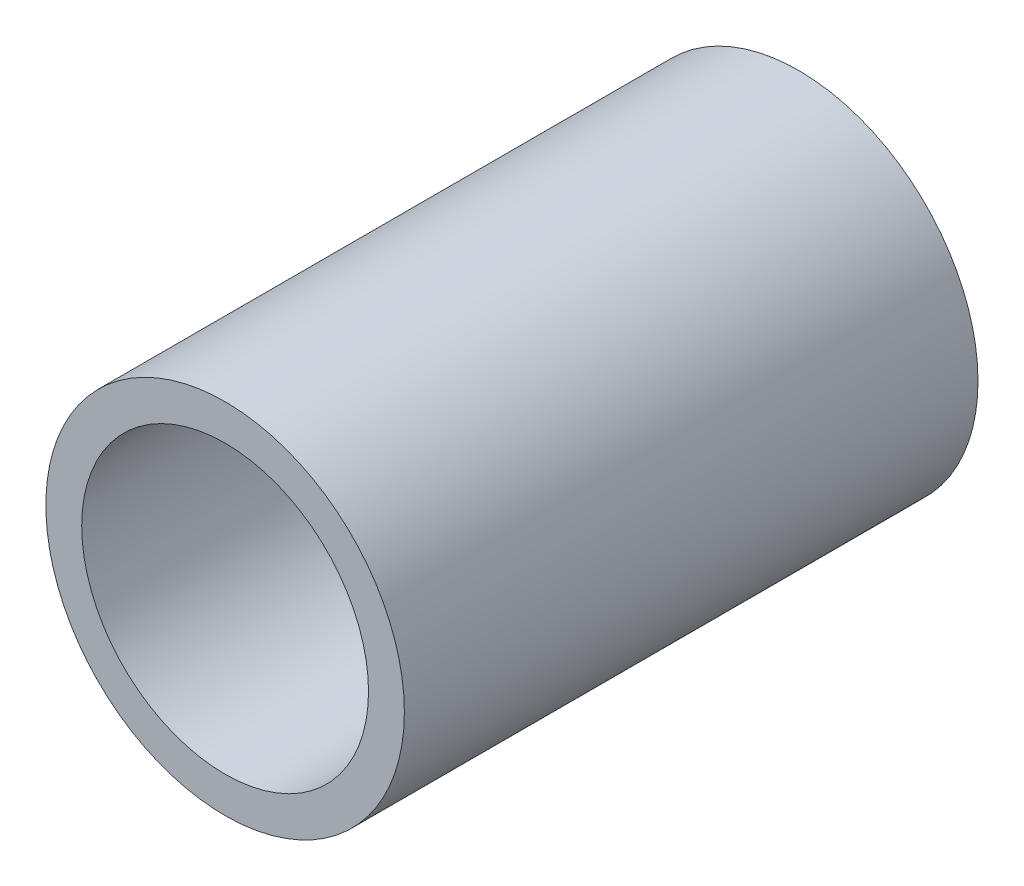
ISO-10303-21;
HEADER;
FILE_DESCRIPTION(('STEP AP214'),'2;1');
FILE_NAME('part.step','',(''),(''),'','','');
FILE_SCHEMA(('AUTOMOTIVE_DESIGN { 1 0 10303 214 1 1 1 1 }'));
ENDSEC;
DATA;
#1=APPLICATION_CONTEXT('core data for automotive mechanical design processes');
#2=APPLICATION_PROTOCOL_DEFINITION('international standard','automotive_design',2000,#1);
#3=PRODUCT_CONTEXT('',#1,'mechanical');
#4=PRODUCT('Part','Part','',(#3));
#5=PRODUCT_RELATED_PRODUCT_CATEGORY('part','',(#4));
#6=PRODUCT_DEFINITION_FORMATION('','',#4);
#7=PRODUCT_DEFINITION_CONTEXT('part definition',#1,'design');
#8=PRODUCT_DEFINITION('design','',#6,#7);
#9=PRODUCT_DEFINITION_SHAPE('','',#8);
#10=(LENGTH_UNIT() NAMED_UNIT(*) SI_UNIT(.MILLI.,.METRE.));
#11=(NAMED_UNIT(*) PLANE_ANGLE_UNIT() SI_UNIT($,.RADIAN.));
#12=(NAMED_UNIT(*) SI_UNIT($,.STERADIAN.) SOLID_ANGLE_UNIT());
#13=UNCERTAINTY_MEASURE_WITH_UNIT(LENGTH_MEASURE(1.E-05),#10,'distance_accuracy_value','');
#14=(GEOMETRIC_REPRESENTATION_CONTEXT(3) GLOBAL_UNCERTAINTY_ASSIGNED_CONTEXT((#13)) GLOBAL_UNIT_ASSIGNED_CONTEXT((#10,
#11,#12)) REPRESENTATION_CONTEXT('',''));
#15=CARTESIAN_POINT('',(0.,0.,0.));
#16=DIRECTION('',(0.,0.,1.));
#17=DIRECTION('',(1.,0.,0.));
#18=AXIS2_PLACEMENT_3D('',#15,#16,#17);
#19=CARTESIAN_POINT('',(0.,0.,1.));
#20=DIRECTION('',(0.,0.,-1.));
#21=DIRECTION('',(-1.,0.,0.));
#22=AXIS2_PLACEMENT_3D('',#19,#20,#21);
#23=CYLINDRICAL_SURFACE('',#22,5.);
#24=CARTESIAN_POINT('',(0.,0.,0.));
#25=DIRECTION('',(0.,0.,1.));
#26=DIRECTION('',(1.,0.,0.));
#27=AXIS2_PLACEMENT_3D('',#24,#25,#26);
#28=CIRCLE('',#27,5.);
#29=CARTESIAN_POINT('',(5.,0.,0.));
#30=VERTEX_POINT('',#29);
#31=EDGE_CURVE('E39',#30,#30,#28,.T.);
#32=ORIENTED_EDGE('',*,*,#31,.T.);
#33=EDGE_LOOP('',(#32));
#34=FACE_BOUND('',#33,.T.);
#35=CARTESIAN_POINT('',(0.,0.,16.));
#36=DIRECTION('',(0.,0.,1.));
#37=DIRECTION('',(1.,0.,0.));
#38=AXIS2_PLACEMENT_3D('',#35,#36,#37);
#39=CIRCLE('',#38,5.);
#40=CARTESIAN_POINT('',(5.,0.,16.));
#41=VERTEX_POINT('',#40);
#42=EDGE_CURVE('E43',#41,#41,#39,.T.);
#43=ORIENTED_EDGE('',*,*,#42,.F.);
#44=EDGE_LOOP('',(#43));
#45=FACE_BOUND('',#44,.T.);
#46=ADVANCED_FACE('F33',(#34,#45),#23,.T.);
#47=CARTESIAN_POINT('',(0.,0.,0.));
#48=DIRECTION('',(0.,0.,1.));
#49=DIRECTION('',(1.,0.,0.));
#50=AXIS2_PLACEMENT_3D('',#47,#48,#49);
#51=PLANE('',#50);
#52=ORIENTED_EDGE('',*,*,#31,.F.);
#53=EDGE_LOOP('',(#52));
#54=FACE_BOUND('',#53,.T.);
#55=ADVANCED_FACE('F57',(#54),#51,.F.);
#56=CARTESIAN_POINT('',(0.,0.,16.));
#57=DIRECTION('',(0.,0.,1.));
#58=DIRECTION('',(1.,0.,0.));
#59=AXIS2_PLACEMENT_3D('',#56,#57,#58);
#60=PLANE('',#59);
#61=ORIENTED_EDGE('',*,*,#42,.T.);
#62=EDGE_LOOP('',(#61));
#63=FACE_BOUND('',#62,.T.);
#64=CARTESIAN_POINT('',(0.,0.,16.));
#65=DIRECTION('',(0.,0.,1.));
#66=DIRECTION('',(1.,0.,0.));
#67=AXIS2_PLACEMENT_3D('',#64,#65,#66);
#68=CIRCLE('',#67,4.);
#69=CARTESIAN_POINT('',(4.,0.,16.));
#70=VERTEX_POINT('',#69);
#71=EDGE_CURVE('E47',#70,#70,#68,.T.);
#72=ORIENTED_EDGE('',*,*,#71,.F.);
#73=EDGE_LOOP('',(#72));
#74=FACE_BOUND('',#73,.T.);
#75=ADVANCED_FACE('F55',(#63,#74),#60,.T.);
#76=CARTESIAN_POINT('',(0.,0.,16.));
#77=DIRECTION('',(0.,0.,-1.));
#78=DIRECTION('',(-1.,0.,0.));
#79=AXIS2_PLACEMENT_3D('',#76,#77,#78);
#80=CYLINDRICAL_SURFACE('',#79,4.);
#81=ORIENTED_EDGE('',*,*,#71,.T.);
#82=EDGE_LOOP('',(#81));
#83=FACE_BOUND('',#82,.T.);
#84=CARTESIAN_POINT('',(0.,0.,1.));
#85=DIRECTION('',(0.,0.,1.));
#86=DIRECTION('',(1.,0.,0.));
#87=AXIS2_PLACEMENT_3D('',#84,#85,#86);
#88=CIRCLE('',#87,4.);
#89=CARTESIAN_POINT('',(4.,0.,1.));
#90=VERTEX_POINT('',#89);
#91=EDGE_CURVE('E10',#90,#90,#88,.F.);
#92=ORIENTED_EDGE('',*,*,#91,.T.);
#93=EDGE_LOOP('',(#92));
#94=FACE_BOUND('',#93,.T.);
#95=ADVANCED_FACE('F53',(#83,#94),#80,.F.);
#96=CARTESIAN_POINT('',(0.,0.,1.));
#97=DIRECTION('',(0.,0.,1.));
#98=DIRECTION('',(1.,0.,0.));
#99=AXIS2_PLACEMENT_3D('',#96,#97,#98);
#100=PLANE('',#99);
#101=ORIENTED_EDGE('',*,*,#91,.F.);
#102=EDGE_LOOP('',(#101));
#103=FACE_BOUND('',#102,.T.);
#104=ADVANCED_FACE('F64',(#103),#100,.T.);
#105=CLOSED_SHELL('',(#46,#55,#75,#95,#104));
#106=MANIFOLD_SOLID_BREP('B2',#105);
#107=ADVANCED_BREP_SHAPE_REPRESENTATION('',(#18,#106),#14);
#108=SHAPE_DEFINITION_REPRESENTATION(#9,#107);
ENDSEC;
END-ISO-10303-21;
